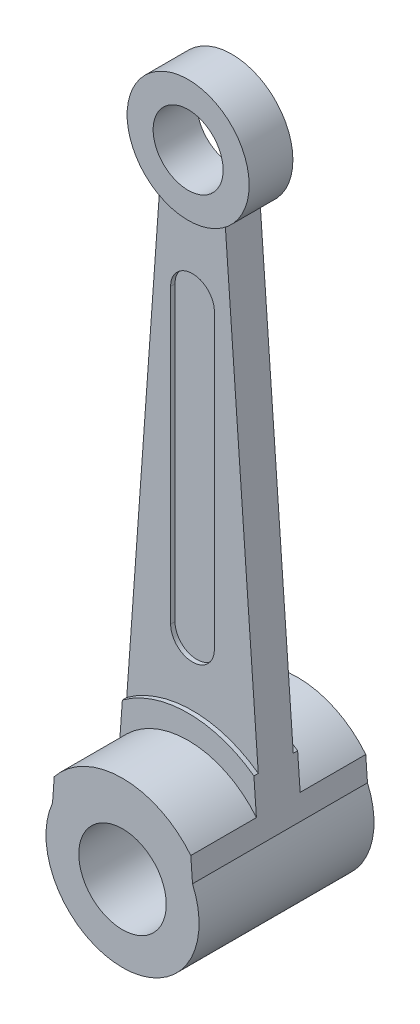
ISO-10303-21;
HEADER;
FILE_DESCRIPTION(('STEP AP214'),'2;1');
FILE_NAME('part.step','',(''),(''),'','','');
FILE_SCHEMA(('AUTOMOTIVE_DESIGN { 1 0 10303 214 1 1 1 1 }'));
ENDSEC;
DATA;
#1=APPLICATION_CONTEXT('core data for automotive mechanical design processes');
#2=APPLICATION_PROTOCOL_DEFINITION('international standard','automotive_design',2000,#1);
#3=PRODUCT_CONTEXT('',#1,'mechanical');
#4=PRODUCT('Part','Part','',(#3));
#5=PRODUCT_RELATED_PRODUCT_CATEGORY('part','',(#4));
#6=PRODUCT_DEFINITION_FORMATION('','',#4);
#7=PRODUCT_DEFINITION_CONTEXT('part definition',#1,'design');
#8=PRODUCT_DEFINITION('design','',#6,#7);
#9=PRODUCT_DEFINITION_SHAPE('','',#8);
#10=(LENGTH_UNIT() NAMED_UNIT(*) SI_UNIT(.MILLI.,.METRE.));
#11=(NAMED_UNIT(*) PLANE_ANGLE_UNIT() SI_UNIT($,.RADIAN.));
#12=(NAMED_UNIT(*) SI_UNIT($,.STERADIAN.) SOLID_ANGLE_UNIT());
#13=UNCERTAINTY_MEASURE_WITH_UNIT(LENGTH_MEASURE(1.E-05),#10,'distance_accuracy_value','');
#14=(GEOMETRIC_REPRESENTATION_CONTEXT(3) GLOBAL_UNCERTAINTY_ASSIGNED_CONTEXT((#13)) GLOBAL_UNIT_ASSIGNED_CONTEXT((#10,
#11,#12)) REPRESENTATION_CONTEXT('',''));
#15=CARTESIAN_POINT('',(0.,0.,0.));
#16=DIRECTION('',(0.,0.,1.));
#17=DIRECTION('',(1.,0.,0.));
#18=AXIS2_PLACEMENT_3D('',#15,#16,#17);
#19=CARTESIAN_POINT('',(1.86324788101989,-1.90582535700159,-0.499999999999999));
#20=DIRECTION('',(0.,0.,1.));
#21=DIRECTION('',(1.,0.,0.));
#22=AXIS2_PLACEMENT_3D('',#19,#20,#21);
#23=CYLINDRICAL_SURFACE('',#22,2.54);
#24=DIRECTION('',(0.,0.,1.));
#25=VECTOR('',#24,1.);
#26=CARTESIAN_POINT('',(3.36688931810119,0.141285394445941,-0.499999999999999));
#27=LINE('',#26,#25);
#28=CARTESIAN_POINT('',(3.36688931810119,0.141285394445941,-0.499999999999999));
#29=VERTEX_POINT('',#28);
#30=CARTESIAN_POINT('',(3.36688931810119,0.141285394445941,-0.399999999999999));
#31=VERTEX_POINT('',#30);
#32=EDGE_CURVE('E319',#29,#31,#27,.T.);
#33=ORIENTED_EDGE('',*,*,#32,.F.);
#34=CARTESIAN_POINT('',(1.86324788101989,-1.90582535700159,-0.499999999999999));
#35=DIRECTION('',(0.,0.,1.));
#36=DIRECTION('',(1.,0.,0.));
#37=AXIS2_PLACEMENT_3D('',#34,#35,#36);
#38=CIRCLE('',#37,2.54);
#39=CARTESIAN_POINT('',(0.359606443938589,0.141285394445941,-0.499999999999999));
#40=VERTEX_POINT('',#39);
#41=EDGE_CURVE('E200',#29,#40,#38,.T.);
#42=ORIENTED_EDGE('',*,*,#41,.T.);
#43=DIRECTION('',(0.,0.,1.));
#44=VECTOR('',#43,1.);
#45=CARTESIAN_POINT('',(0.359606443938589,0.141285394445941,-0.499999999999999));
#46=LINE('',#45,#44);
#47=CARTESIAN_POINT('',(0.359606443938589,0.141285394445941,-0.399999999999999));
#48=VERTEX_POINT('',#47);
#49=EDGE_CURVE('E338',#48,#40,#46,.F.);
#50=ORIENTED_EDGE('',*,*,#49,.F.);
#51=CARTESIAN_POINT('',(1.86324788101989,-1.90582535700159,-0.399999999999999));
#52=DIRECTION('',(0.,0.,1.));
#53=DIRECTION('',(1.,0.,0.));
#54=AXIS2_PLACEMENT_3D('',#51,#52,#53);
#55=CIRCLE('',#54,2.54);
#56=EDGE_CURVE('E227',#31,#48,#55,.T.);
#57=ORIENTED_EDGE('',*,*,#56,.F.);
#58=EDGE_LOOP('',(#33,#42,#50,#57));
#59=FACE_BOUND('',#58,.T.);
#60=ADVANCED_FACE('F41',(#59),#23,.T.);
#61=CARTESIAN_POINT('',(1.86324788101989,2.09417464299841,0.400000000000001));
#62=DIRECTION('',(0.,0.,-1.));
#63=DIRECTION('',(-1.,0.,0.));
#64=AXIS2_PLACEMENT_3D('',#61,#62,#63);
#65=CYLINDRICAL_SURFACE('',#64,0.5);
#66=DIRECTION('',(0.,0.,-1.));
#67=VECTOR('',#66,1.);
#68=CARTESIAN_POINT('',(1.36324788101989,2.09417464299841,0.400000000000001));
#69=LINE('',#68,#67);
#70=CARTESIAN_POINT('',(1.36324788101989,2.09417464299841,-0.299999999999999));
#71=VERTEX_POINT('',#70);
#72=CARTESIAN_POINT('',(1.36324788101989,2.09417464299841,-0.399999999999999));
#73=VERTEX_POINT('',#72);
#74=EDGE_CURVE('E211',#71,#73,#69,.T.);
#75=ORIENTED_EDGE('',*,*,#74,.F.);
#76=CARTESIAN_POINT('',(1.86324788101989,2.09417464299841,-0.299999999999999));
#77=DIRECTION('',(0.,0.,1.));
#78=DIRECTION('',(1.,0.,0.));
#79=AXIS2_PLACEMENT_3D('',#76,#77,#78);
#80=CIRCLE('',#79,0.5);
#81=CARTESIAN_POINT('',(2.36324788101989,2.09417464299841,-0.299999999999999));
#82=VERTEX_POINT('',#81);
#83=EDGE_CURVE('E281',#71,#82,#80,.T.);
#84=ORIENTED_EDGE('',*,*,#83,.T.);
#85=DIRECTION('',(0.,0.,-1.));
#86=VECTOR('',#85,1.);
#87=CARTESIAN_POINT('',(2.36324788101989,2.09417464299841,0.400000000000001));
#88=LINE('',#87,#86);
#89=CARTESIAN_POINT('',(2.36324788101989,2.09417464299841,-0.399999999999999));
#90=VERTEX_POINT('',#89);
#91=EDGE_CURVE('E223',#82,#90,#88,.T.);
#92=ORIENTED_EDGE('',*,*,#91,.T.);
#93=CARTESIAN_POINT('',(1.86324788101989,2.09417464299841,-0.399999999999999));
#94=DIRECTION('',(0.,0.,1.));
#95=DIRECTION('',(1.,0.,0.));
#96=AXIS2_PLACEMENT_3D('',#93,#94,#95);
#97=CIRCLE('',#96,0.5);
#98=EDGE_CURVE('E243',#73,#90,#97,.T.);
#99=ORIENTED_EDGE('',*,*,#98,.F.);
#100=EDGE_LOOP('',(#75,#84,#92,#99));
#101=FACE_BOUND('',#100,.T.);
#102=ADVANCED_FACE('F399',(#101),#65,.F.);
#103=CARTESIAN_POINT('',(1.36324788101989,1.35174813270071,0.400000000000001));
#104=DIRECTION('',(1.,0.,0.));
#105=DIRECTION('',(0.,1.,0.));
#106=AXIS2_PLACEMENT_3D('',#103,#104,#105);
#107=PLANE('',#106);
#108=DIRECTION('',(0.,0.,-1.));
#109=VECTOR('',#108,1.);
#110=CARTESIAN_POINT('',(1.36324788101989,8.78417464299841,0.400000000000001));
#111=LINE('',#110,#109);
#112=CARTESIAN_POINT('',(1.36324788101989,8.78417464299841,-0.299999999999999));
#113=VERTEX_POINT('',#112);
#114=CARTESIAN_POINT('',(1.36324788101989,8.78417464299841,-0.399999999999999));
#115=VERTEX_POINT('',#114);
#116=EDGE_CURVE('E215',#113,#115,#111,.T.);
#117=ORIENTED_EDGE('',*,*,#116,.F.);
#118=DIRECTION('',(0.,-1.,0.));
#119=VECTOR('',#118,1.);
#120=CARTESIAN_POINT('',(1.36324788101989,1.35174813270071,-0.299999999999999));
#121=LINE('',#120,#119);
#122=EDGE_CURVE('E64',#113,#71,#121,.T.);
#123=ORIENTED_EDGE('',*,*,#122,.T.);
#124=ORIENTED_EDGE('',*,*,#74,.T.);
#125=DIRECTION('',(0.,-1.,0.));
#126=VECTOR('',#125,1.);
#127=CARTESIAN_POINT('',(1.36324788101989,1.35174813270071,-0.399999999999999));
#128=LINE('',#127,#126);
#129=EDGE_CURVE('E240',#115,#73,#128,.T.);
#130=ORIENTED_EDGE('',*,*,#129,.F.);
#131=EDGE_LOOP('',(#117,#123,#124,#130));
#132=FACE_BOUND('',#131,.T.);
#133=ADVANCED_FACE('F403',(#132),#107,.T.);
#134=CARTESIAN_POINT('',(1.86324788101989,8.78417464299841,0.400000000000001));
#135=DIRECTION('',(0.,0.,-1.));
#136=DIRECTION('',(-1.,0.,0.));
#137=AXIS2_PLACEMENT_3D('',#134,#135,#136);
#138=CYLINDRICAL_SURFACE('',#137,0.5);
#139=DIRECTION('',(0.,0.,-1.));
#140=VECTOR('',#139,1.);
#141=CARTESIAN_POINT('',(2.36324788101989,8.78417464299841,0.400000000000001));
#142=LINE('',#141,#140);
#143=CARTESIAN_POINT('',(2.36324788101989,8.78417464299841,-0.299999999999999));
#144=VERTEX_POINT('',#143);
#145=CARTESIAN_POINT('',(2.36324788101989,8.78417464299841,-0.399999999999999));
#146=VERTEX_POINT('',#145);
#147=EDGE_CURVE('E219',#144,#146,#142,.T.);
#148=ORIENTED_EDGE('',*,*,#147,.F.);
#149=CARTESIAN_POINT('',(1.86324788101989,8.78417464299841,-0.299999999999999));
#150=DIRECTION('',(0.,0.,1.));
#151=DIRECTION('',(1.,0.,0.));
#152=AXIS2_PLACEMENT_3D('',#149,#150,#151);
#153=CIRCLE('',#152,0.5);
#154=EDGE_CURVE('E275',#144,#113,#153,.T.);
#155=ORIENTED_EDGE('',*,*,#154,.T.);
#156=ORIENTED_EDGE('',*,*,#116,.T.);
#157=CARTESIAN_POINT('',(1.86324788101989,8.78417464299841,-0.399999999999999));
#158=DIRECTION('',(0.,0.,1.));
#159=DIRECTION('',(1.,0.,0.));
#160=AXIS2_PLACEMENT_3D('',#157,#158,#159);
#161=CIRCLE('',#160,0.5);
#162=EDGE_CURVE('E237',#146,#115,#161,.T.);
#163=ORIENTED_EDGE('',*,*,#162,.F.);
#164=EDGE_LOOP('',(#148,#155,#156,#163));
#165=FACE_BOUND('',#164,.T.);
#166=ADVANCED_FACE('F415',(#165),#138,.F.);
#167=CARTESIAN_POINT('',(2.36324788101989,1.35174813270071,0.400000000000001));
#168=DIRECTION('',(1.,0.,0.));
#169=DIRECTION('',(0.,1.,0.));
#170=AXIS2_PLACEMENT_3D('',#167,#168,#169);
#171=PLANE('',#170);
#172=DIRECTION('',(0.,-1.,0.));
#173=VECTOR('',#172,1.);
#174=CARTESIAN_POINT('',(2.36324788101989,1.35174813270071,-0.299999999999999));
#175=LINE('',#174,#173);
#176=EDGE_CURVE('E278',#144,#82,#175,.T.);
#177=ORIENTED_EDGE('',*,*,#176,.F.);
#178=ORIENTED_EDGE('',*,*,#147,.T.);
#179=DIRECTION('',(0.,-1.,0.));
#180=VECTOR('',#179,1.);
#181=CARTESIAN_POINT('',(2.36324788101989,1.35174813270071,-0.399999999999999));
#182=LINE('',#181,#180);
#183=EDGE_CURVE('E234',#146,#90,#182,.T.);
#184=ORIENTED_EDGE('',*,*,#183,.T.);
#185=ORIENTED_EDGE('',*,*,#91,.F.);
#186=EDGE_LOOP('',(#177,#178,#184,#185));
#187=FACE_BOUND('',#186,.T.);
#188=ADVANCED_FACE('F409',(#187),#171,.F.);
#189=CARTESIAN_POINT('',(3.36688931810119,0.141285394445941,0.400000000000001));
#190=VERTEX_POINT('',#189);
#191=CARTESIAN_POINT('',(3.36688931810119,0.141285394445941,0.500000000000001));
#192=VERTEX_POINT('',#191);
#193=EDGE_CURVE('E309',#190,#192,#27,.T.);
#194=ORIENTED_EDGE('',*,*,#193,.F.);
#195=CARTESIAN_POINT('',(1.86324788101989,-1.90582535700159,0.400000000000001));
#196=DIRECTION('',(0.,0.,1.));
#197=DIRECTION('',(1.,0.,0.));
#198=AXIS2_PLACEMENT_3D('',#195,#196,#197);
#199=CIRCLE('',#198,2.54);
#200=CARTESIAN_POINT('',(0.359606443938589,0.141285394445941,0.400000000000001));
#201=VERTEX_POINT('',#200);
#202=EDGE_CURVE('E247',#190,#201,#199,.T.);
#203=ORIENTED_EDGE('',*,*,#202,.T.);
#204=CARTESIAN_POINT('',(0.359606443938589,0.141285394445941,0.500000000000001));
#205=VERTEX_POINT('',#204);
#206=EDGE_CURVE('E328',#205,#201,#46,.F.);
#207=ORIENTED_EDGE('',*,*,#206,.F.);
#208=CARTESIAN_POINT('',(1.86324788101989,-1.90582535700159,0.500000000000001));
#209=DIRECTION('',(0.,0.,1.));
#210=DIRECTION('',(1.,0.,0.));
#211=AXIS2_PLACEMENT_3D('',#208,#209,#210);
#212=CIRCLE('',#211,2.54);
#213=EDGE_CURVE('E201',#192,#205,#212,.T.);
#214=ORIENTED_EDGE('',*,*,#213,.F.);
#215=EDGE_LOOP('',(#194,#203,#207,#214));
#216=FACE_BOUND('',#215,.T.);
#217=ADVANCED_FACE('F364',(#216),#23,.T.);
#218=CARTESIAN_POINT('',(1.6769230929179,1.35174813270071,-0.499999999999999));
#219=DIRECTION('',(0.,0.,1.));
#220=DIRECTION('',(1.,0.,0.));
#221=AXIS2_PLACEMENT_3D('',#218,#219,#220);
#222=PLANE('',#221);
#223=ORIENTED_EDGE('',*,*,#41,.F.);
#224=DIRECTION('',(0.0718181006562888,-0.997417746191696,0.));
#225=VECTOR('',#224,1.);
#226=CARTESIAN_POINT('',(3.27146409205458,1.46656151597349,-0.499999999999999));
#227=LINE('',#226,#225);
#228=CARTESIAN_POINT('',(3.42426347546753,-0.655533265572038,-0.499999999999999));
#229=VERTEX_POINT('',#228);
#230=EDGE_CURVE('E321',#29,#229,#227,.T.);
#231=ORIENTED_EDGE('',*,*,#230,.T.);
#232=CARTESIAN_POINT('',(1.86324788101989,-1.90582535700159,-0.499999999999999));
#233=DIRECTION('',(0.,0.,1.));
#234=DIRECTION('',(1.,0.,0.));
#235=AXIS2_PLACEMENT_3D('',#232,#233,#234);
#236=CIRCLE('',#235,2.);
#237=CARTESIAN_POINT('',(0.302232286572251,-0.655533265572039,-0.499999999999999));
#238=VERTEX_POINT('',#237);
#239=EDGE_CURVE('E285',#229,#238,#236,.T.);
#240=ORIENTED_EDGE('',*,*,#239,.T.);
#241=DIRECTION('',(0.0718181006562885,0.997417746191696,0.));
#242=VECTOR('',#241,1.);
#243=CARTESIAN_POINT('',(0.453109603250883,1.4398676400195,-0.499999999999999));
#244=LINE('',#243,#242);
#245=EDGE_CURVE('E340',#238,#40,#244,.T.);
#246=ORIENTED_EDGE('',*,*,#245,.T.);
#247=EDGE_LOOP('',(#223,#231,#240,#246));
#248=FACE_BOUND('',#247,.T.);
#249=ADVANCED_FACE('F384',(#248),#222,.F.);
#250=CARTESIAN_POINT('',(1.6769230929179,1.35174813270071,0.500000000000001));
#251=DIRECTION('',(0.,0.,1.));
#252=DIRECTION('',(1.,0.,0.));
#253=AXIS2_PLACEMENT_3D('',#250,#251,#252);
#254=PLANE('',#253);
#255=DIRECTION('',(0.0718181006562888,-0.997417746191696,0.));
#256=VECTOR('',#255,1.);
#257=CARTESIAN_POINT('',(3.27146409205458,1.46656151597349,0.500000000000001));
#258=LINE('',#257,#256);
#259=CARTESIAN_POINT('',(3.42426347546753,-0.655533265572038,0.500000000000001));
#260=VERTEX_POINT('',#259);
#261=EDGE_CURVE('E310',#192,#260,#258,.T.);
#262=ORIENTED_EDGE('',*,*,#261,.F.);
#263=ORIENTED_EDGE('',*,*,#213,.T.);
#264=DIRECTION('',(0.0718181006562885,0.997417746191696,0.));
#265=VECTOR('',#264,1.);
#266=CARTESIAN_POINT('',(0.453109603250883,1.4398676400195,0.500000000000001));
#267=LINE('',#266,#265);
#268=CARTESIAN_POINT('',(0.302232286572251,-0.655533265572039,0.500000000000001));
#269=VERTEX_POINT('',#268);
#270=EDGE_CURVE('E329',#269,#205,#267,.T.);
#271=ORIENTED_EDGE('',*,*,#270,.F.);
#272=CARTESIAN_POINT('',(1.86324788101989,-1.90582535700159,0.500000000000001));
#273=DIRECTION('',(0.,0.,1.));
#274=DIRECTION('',(1.,0.,0.));
#275=AXIS2_PLACEMENT_3D('',#272,#273,#274);
#276=CIRCLE('',#275,2.);
#277=EDGE_CURVE('E186',#260,#269,#276,.T.);
#278=ORIENTED_EDGE('',*,*,#277,.F.);
#279=EDGE_LOOP('',(#262,#263,#271,#278));
#280=FACE_BOUND('',#279,.T.);
#281=ADVANCED_FACE('F358',(#280),#254,.T.);
#282=CARTESIAN_POINT('',(1.86324788101989,2.09417464299841,0.300000000000001));
#283=DIRECTION('',(0.,0.,1.));
#284=DIRECTION('',(1.,0.,0.));
#285=AXIS2_PLACEMENT_3D('',#282,#283,#284);
#286=CIRCLE('',#285,0.5);
#287=CARTESIAN_POINT('',(1.36324788101989,2.09417464299841,0.300000000000001));
#288=VERTEX_POINT('',#287);
#289=CARTESIAN_POINT('',(2.36324788101989,2.09417464299841,0.300000000000001));
#290=VERTEX_POINT('',#289);
#291=EDGE_CURVE('E290',#288,#290,#286,.T.);
#292=ORIENTED_EDGE('',*,*,#291,.F.);
#293=CARTESIAN_POINT('',(1.36324788101989,2.09417464299841,0.400000000000001));
#294=VERTEX_POINT('',#293);
#295=EDGE_CURVE('E207',#294,#288,#69,.T.);
#296=ORIENTED_EDGE('',*,*,#295,.F.);
#297=CARTESIAN_POINT('',(1.86324788101989,2.09417464299841,0.400000000000001));
#298=DIRECTION('',(0.,0.,1.));
#299=DIRECTION('',(1.,0.,0.));
#300=AXIS2_PLACEMENT_3D('',#297,#298,#299);
#301=CIRCLE('',#300,0.5);
#302=CARTESIAN_POINT('',(2.36324788101989,2.09417464299841,0.400000000000001));
#303=VERTEX_POINT('',#302);
#304=EDGE_CURVE('E230',#294,#303,#301,.T.);
#305=ORIENTED_EDGE('',*,*,#304,.T.);
#306=EDGE_CURVE('E220',#303,#290,#88,.T.);
#307=ORIENTED_EDGE('',*,*,#306,.T.);
#308=EDGE_LOOP('',(#292,#296,#305,#307));
#309=FACE_BOUND('',#308,.T.);
#310=ADVANCED_FACE('F406',(#309),#65,.F.);
#311=DIRECTION('',(0.,-1.,0.));
#312=VECTOR('',#311,1.);
#313=CARTESIAN_POINT('',(1.36324788101989,1.35174813270071,0.300000000000001));
#314=LINE('',#313,#312);
#315=CARTESIAN_POINT('',(1.36324788101989,8.78417464299841,0.300000000000001));
#316=VERTEX_POINT('',#315);
#317=EDGE_CURVE('E277',#316,#288,#314,.T.);
#318=ORIENTED_EDGE('',*,*,#317,.F.);
#319=CARTESIAN_POINT('',(1.36324788101989,8.78417464299841,0.400000000000001));
#320=VERTEX_POINT('',#319);
#321=EDGE_CURVE('E212',#320,#316,#111,.T.);
#322=ORIENTED_EDGE('',*,*,#321,.F.);
#323=DIRECTION('',(0.,-1.,0.));
#324=VECTOR('',#323,1.);
#325=CARTESIAN_POINT('',(1.36324788101989,1.35174813270071,0.400000000000001));
#326=LINE('',#325,#324);
#327=EDGE_CURVE('E258',#320,#294,#326,.T.);
#328=ORIENTED_EDGE('',*,*,#327,.T.);
#329=ORIENTED_EDGE('',*,*,#295,.T.);
#330=EDGE_LOOP('',(#318,#322,#328,#329));
#331=FACE_BOUND('',#330,.T.);
#332=ADVANCED_FACE('F433',(#331),#107,.T.);
#333=CARTESIAN_POINT('',(1.86324788101989,8.78417464299841,0.300000000000001));
#334=DIRECTION('',(0.,0.,1.));
#335=DIRECTION('',(1.,0.,0.));
#336=AXIS2_PLACEMENT_3D('',#333,#334,#335);
#337=CIRCLE('',#336,0.5);
#338=CARTESIAN_POINT('',(2.36324788101989,8.78417464299841,0.300000000000001));
#339=VERTEX_POINT('',#338);
#340=EDGE_CURVE('E270',#339,#316,#337,.T.);
#341=ORIENTED_EDGE('',*,*,#340,.F.);
#342=CARTESIAN_POINT('',(2.36324788101989,8.78417464299841,0.400000000000001));
#343=VERTEX_POINT('',#342);
#344=EDGE_CURVE('E216',#343,#339,#142,.T.);
#345=ORIENTED_EDGE('',*,*,#344,.F.);
#346=CARTESIAN_POINT('',(1.86324788101989,8.78417464299841,0.400000000000001));
#347=DIRECTION('',(0.,0.,1.));
#348=DIRECTION('',(1.,0.,0.));
#349=AXIS2_PLACEMENT_3D('',#346,#347,#348);
#350=CIRCLE('',#349,0.5);
#351=EDGE_CURVE('E255',#343,#320,#350,.T.);
#352=ORIENTED_EDGE('',*,*,#351,.T.);
#353=ORIENTED_EDGE('',*,*,#321,.T.);
#354=EDGE_LOOP('',(#341,#345,#352,#353));
#355=FACE_BOUND('',#354,.T.);
#356=ADVANCED_FACE('F424',(#355),#138,.F.);
#357=ORIENTED_EDGE('',*,*,#344,.T.);
#358=DIRECTION('',(0.,-1.,0.));
#359=VECTOR('',#358,1.);
#360=CARTESIAN_POINT('',(2.36324788101989,1.35174813270071,0.300000000000001));
#361=LINE('',#360,#359);
#362=EDGE_CURVE('E287',#339,#290,#361,.T.);
#363=ORIENTED_EDGE('',*,*,#362,.T.);
#364=ORIENTED_EDGE('',*,*,#306,.F.);
#365=DIRECTION('',(0.,-1.,0.));
#366=VECTOR('',#365,1.);
#367=CARTESIAN_POINT('',(2.36324788101989,1.35174813270071,0.400000000000001));
#368=LINE('',#367,#366);
#369=EDGE_CURVE('E253',#343,#303,#368,.T.);
#370=ORIENTED_EDGE('',*,*,#369,.F.);
#371=EDGE_LOOP('',(#357,#363,#364,#370));
#372=FACE_BOUND('',#371,.T.);
#373=ADVANCED_FACE('F418',(#372),#171,.F.);
#374=CARTESIAN_POINT('',(1.6769230929179,1.35174813270071,0.400000000000001));
#375=DIRECTION('',(0.,0.,1.));
#376=DIRECTION('',(1.,0.,0.));
#377=AXIS2_PLACEMENT_3D('',#374,#375,#376);
#378=PLANE('',#377);
#379=DIRECTION('',(0.0718181006562888,-0.997417746191696,0.));
#380=VECTOR('',#379,1.);
#381=CARTESIAN_POINT('',(3.27146409205458,1.46656151597349,0.400000000000001));
#382=LINE('',#381,#380);
#383=CARTESIAN_POINT('',(2.61324788101989,10.6079412477915,0.400000000000001));
#384=VERTEX_POINT('',#383);
#385=EDGE_CURVE('E307',#384,#190,#382,.T.);
#386=ORIENTED_EDGE('',*,*,#385,.F.);
#387=CARTESIAN_POINT('',(1.86324788101989,11.7841746429984,0.400000000000001));
#388=DIRECTION('',(0.,0.,1.));
#389=DIRECTION('',(1.,0.,0.));
#390=AXIS2_PLACEMENT_3D('',#387,#388,#389);
#391=CIRCLE('',#390,1.395);
#392=CARTESIAN_POINT('',(1.11324788101989,10.6079412477915,0.400000000000001));
#393=VERTEX_POINT('',#392);
#394=EDGE_CURVE('E250',#393,#384,#391,.T.);
#395=ORIENTED_EDGE('',*,*,#394,.F.);
#396=DIRECTION('',(0.0718181006562885,0.997417746191696,0.));
#397=VECTOR('',#396,1.);
#398=CARTESIAN_POINT('',(0.453109603250883,1.4398676400195,0.400000000000001));
#399=LINE('',#398,#397);
#400=EDGE_CURVE('E326',#201,#393,#399,.T.);
#401=ORIENTED_EDGE('',*,*,#400,.F.);
#402=ORIENTED_EDGE('',*,*,#202,.F.);
#403=EDGE_LOOP('',(#386,#395,#401,#402));
#404=FACE_BOUND('',#403,.T.);
#405=ORIENTED_EDGE('',*,*,#304,.F.);
#406=ORIENTED_EDGE('',*,*,#327,.F.);
#407=ORIENTED_EDGE('',*,*,#351,.F.);
#408=ORIENTED_EDGE('',*,*,#369,.T.);
#409=EDGE_LOOP('',(#405,#406,#407,#408));
#410=FACE_BOUND('',#409,.T.);
#411=ADVANCED_FACE('F368',(#404,#410),#378,.T.);
#412=CARTESIAN_POINT('',(1.6769230929179,1.35174813270071,-0.399999999999999));
#413=DIRECTION('',(0.,0.,1.));
#414=DIRECTION('',(1.,0.,0.));
#415=AXIS2_PLACEMENT_3D('',#412,#413,#414);
#416=PLANE('',#415);
#417=ORIENTED_EDGE('',*,*,#98,.T.);
#418=ORIENTED_EDGE('',*,*,#183,.F.);
#419=ORIENTED_EDGE('',*,*,#162,.T.);
#420=ORIENTED_EDGE('',*,*,#129,.T.);
#421=EDGE_LOOP('',(#417,#418,#419,#420));
#422=FACE_BOUND('',#421,.T.);
#423=CARTESIAN_POINT('',(1.86324788101989,11.7841746429984,-0.399999999999999));
#424=DIRECTION('',(0.,0.,1.));
#425=DIRECTION('',(1.,0.,0.));
#426=AXIS2_PLACEMENT_3D('',#423,#424,#425);
#427=CIRCLE('',#426,1.395);
#428=CARTESIAN_POINT('',(1.11324788101989,10.6079412477915,-0.399999999999999));
#429=VERTEX_POINT('',#428);
#430=CARTESIAN_POINT('',(2.61324788101989,10.6079412477915,-0.399999999999999));
#431=VERTEX_POINT('',#430);
#432=EDGE_CURVE('E231',#429,#431,#427,.T.);
#433=ORIENTED_EDGE('',*,*,#432,.T.);
#434=DIRECTION('',(0.0718181006562888,-0.997417746191696,0.));
#435=VECTOR('',#434,1.);
#436=CARTESIAN_POINT('',(3.27146409205458,1.46656151597349,-0.399999999999999));
#437=LINE('',#436,#435);
#438=EDGE_CURVE('E316',#431,#31,#437,.T.);
#439=ORIENTED_EDGE('',*,*,#438,.T.);
#440=ORIENTED_EDGE('',*,*,#56,.T.);
#441=DIRECTION('',(0.0718181006562885,0.997417746191696,0.));
#442=VECTOR('',#441,1.);
#443=CARTESIAN_POINT('',(0.453109603250883,1.4398676400195,-0.399999999999999));
#444=LINE('',#443,#442);
#445=EDGE_CURVE('E335',#48,#429,#444,.T.);
#446=ORIENTED_EDGE('',*,*,#445,.T.);
#447=EDGE_LOOP('',(#433,#439,#440,#446));
#448=FACE_BOUND('',#447,.T.);
#449=ADVANCED_FACE('F377',(#422,#448),#416,.F.);
#450=CARTESIAN_POINT('',(1.86324788101989,11.7841746429984,-0.499999999999999));
#451=DIRECTION('',(0.,0.,1.));
#452=DIRECTION('',(1.,0.,0.));
#453=AXIS2_PLACEMENT_3D('',#450,#451,#452);
#454=CYLINDRICAL_SURFACE('',#453,0.800000000000001);
#455=CARTESIAN_POINT('',(1.86324788101989,11.7841746429984,-0.499999999999999));
#456=DIRECTION('',(0.,0.,1.));
#457=DIRECTION('',(1.,0.,0.));
#458=AXIS2_PLACEMENT_3D('',#455,#456,#457);
#459=CIRCLE('',#458,0.800000000000001);
#460=CARTESIAN_POINT('',(2.66324788101989,11.7841746429984,-0.499999999999999));
#461=VERTEX_POINT('',#460);
#462=EDGE_CURVE('E266',#461,#461,#459,.T.);
#463=ORIENTED_EDGE('',*,*,#462,.F.);
#464=EDGE_LOOP('',(#463));
#465=FACE_BOUND('',#464,.T.);
#466=CARTESIAN_POINT('',(1.86324788101989,11.7841746429984,0.500000000000001));
#467=DIRECTION('',(0.,0.,1.));
#468=DIRECTION('',(1.,0.,0.));
#469=AXIS2_PLACEMENT_3D('',#466,#467,#468);
#470=CIRCLE('',#469,0.800000000000001);
#471=CARTESIAN_POINT('',(2.66324788101989,11.7841746429984,0.500000000000001));
#472=VERTEX_POINT('',#471);
#473=EDGE_CURVE('E267',#472,#472,#470,.T.);
#474=ORIENTED_EDGE('',*,*,#473,.T.);
#475=EDGE_LOOP('',(#474));
#476=FACE_BOUND('',#475,.T.);
#477=ADVANCED_FACE('F609',(#465,#476),#454,.F.);
#478=CARTESIAN_POINT('',(1.86324788101989,11.7841746429984,-0.499999999999999));
#479=DIRECTION('',(0.,0.,1.));
#480=DIRECTION('',(1.,0.,0.));
#481=AXIS2_PLACEMENT_3D('',#478,#479,#480);
#482=CYLINDRICAL_SURFACE('',#481,1.395);
#483=DIRECTION('',(0.,0.,-1.));
#484=VECTOR('',#483,1.);
#485=CARTESIAN_POINT('',(2.61324788101989,10.6079412477915,0.400000000000001));
#486=LINE('',#485,#484);
#487=EDGE_CURVE('E210',#384,#431,#486,.T.);
#488=ORIENTED_EDGE('',*,*,#487,.T.);
#489=ORIENTED_EDGE('',*,*,#432,.F.);
#490=DIRECTION('',(0.,0.,-1.));
#491=VECTOR('',#490,1.);
#492=CARTESIAN_POINT('',(1.11324788101989,10.6079412477915,0.400000000000001));
#493=LINE('',#492,#491);
#494=EDGE_CURVE('E204',#393,#429,#493,.T.);
#495=ORIENTED_EDGE('',*,*,#494,.F.);
#496=ORIENTED_EDGE('',*,*,#394,.T.);
#497=EDGE_LOOP('',(#488,#489,#495,#496));
#498=FACE_BOUND('',#497,.T.);
#499=CARTESIAN_POINT('',(1.86324788101989,11.7841746429984,0.500000000000001));
#500=DIRECTION('',(0.,0.,1.));
#501=DIRECTION('',(1.,0.,0.));
#502=AXIS2_PLACEMENT_3D('',#499,#500,#501);
#503=CIRCLE('',#502,1.395);
#504=CARTESIAN_POINT('',(3.25824788101989,11.7841746429984,0.500000000000001));
#505=VERTEX_POINT('',#504);
#506=EDGE_CURVE('E263',#505,#505,#503,.T.);
#507=ORIENTED_EDGE('',*,*,#506,.F.);
#508=EDGE_LOOP('',(#507));
#509=FACE_BOUND('',#508,.T.);
#510=CARTESIAN_POINT('',(1.86324788101989,11.7841746429984,-0.499999999999999));
#511=DIRECTION('',(0.,0.,1.));
#512=DIRECTION('',(1.,0.,0.));
#513=AXIS2_PLACEMENT_3D('',#510,#511,#512);
#514=CIRCLE('',#513,1.395);
#515=CARTESIAN_POINT('',(3.25824788101989,11.7841746429984,-0.499999999999999));
#516=VERTEX_POINT('',#515);
#517=EDGE_CURVE('E246',#516,#516,#514,.T.);
#518=ORIENTED_EDGE('',*,*,#517,.T.);
#519=EDGE_LOOP('',(#518));
#520=FACE_BOUND('',#519,.T.);
#521=ADVANCED_FACE('F374',(#498,#509,#520),#482,.T.);
#522=CARTESIAN_POINT('',(1.6769230929179,1.35174813270071,-0.499999999999999));
#523=DIRECTION('',(0.,0.,1.));
#524=DIRECTION('',(1.,0.,0.));
#525=AXIS2_PLACEMENT_3D('',#522,#523,#524);
#526=PLANE('',#525);
#527=ORIENTED_EDGE('',*,*,#462,.T.);
#528=EDGE_LOOP('',(#527));
#529=FACE_BOUND('',#528,.T.);
#530=ORIENTED_EDGE('',*,*,#517,.F.);
#531=EDGE_LOOP('',(#530));
#532=FACE_BOUND('',#531,.T.);
#533=ADVANCED_FACE('F589',(#529,#532),#526,.F.);
#534=CARTESIAN_POINT('',(1.6769230929179,1.35174813270071,0.500000000000001));
#535=DIRECTION('',(0.,0.,1.));
#536=DIRECTION('',(1.,0.,0.));
#537=AXIS2_PLACEMENT_3D('',#534,#535,#536);
#538=PLANE('',#537);
#539=ORIENTED_EDGE('',*,*,#473,.F.);
#540=EDGE_LOOP('',(#539));
#541=FACE_BOUND('',#540,.T.);
#542=ORIENTED_EDGE('',*,*,#506,.T.);
#543=EDGE_LOOP('',(#542));
#544=FACE_BOUND('',#543,.T.);
#545=ADVANCED_FACE('F580',(#541,#544),#538,.T.);
#546=CARTESIAN_POINT('',(1.6769230929179,1.35174813270071,-0.299999999999999));
#547=DIRECTION('',(0.,0.,1.));
#548=DIRECTION('',(1.,0.,0.));
#549=AXIS2_PLACEMENT_3D('',#546,#547,#548);
#550=PLANE('',#549);
#551=ORIENTED_EDGE('',*,*,#122,.F.);
#552=ORIENTED_EDGE('',*,*,#154,.F.);
#553=ORIENTED_EDGE('',*,*,#176,.T.);
#554=ORIENTED_EDGE('',*,*,#83,.F.);
#555=EDGE_LOOP('',(#551,#552,#553,#554));
#556=FACE_BOUND('',#555,.T.);
#557=ADVANCED_FACE('F571',(#556),#550,.F.);
#558=CARTESIAN_POINT('',(1.6769230929179,1.35174813270071,0.300000000000001));
#559=DIRECTION('',(0.,0.,1.));
#560=DIRECTION('',(1.,0.,0.));
#561=AXIS2_PLACEMENT_3D('',#558,#559,#560);
#562=PLANE('',#561);
#563=ORIENTED_EDGE('',*,*,#317,.T.);
#564=ORIENTED_EDGE('',*,*,#291,.T.);
#565=ORIENTED_EDGE('',*,*,#362,.F.);
#566=ORIENTED_EDGE('',*,*,#340,.T.);
#567=EDGE_LOOP('',(#563,#564,#565,#566));
#568=FACE_BOUND('',#567,.T.);
#569=ADVANCED_FACE('F441',(#568),#562,.T.);
#570=CARTESIAN_POINT('',(1.86324788101989,-1.90582535700159,-2.));
#571=DIRECTION('',(0.,0.,1.));
#572=DIRECTION('',(1.,0.,0.));
#573=AXIS2_PLACEMENT_3D('',#570,#571,#572);
#574=CYLINDRICAL_SURFACE('',#573,2.);
#575=DIRECTION('',(0.,0.,1.));
#576=VECTOR('',#575,1.);
#577=CARTESIAN_POINT('',(3.42426347546753,-0.655533265572038,-2.));
#578=LINE('',#577,#576);
#579=CARTESIAN_POINT('',(3.42426347546753,-0.655533265572038,2.));
#580=VERTEX_POINT('',#579);
#581=EDGE_CURVE('E312',#260,#580,#578,.T.);
#582=ORIENTED_EDGE('',*,*,#581,.F.);
#583=ORIENTED_EDGE('',*,*,#277,.T.);
#584=DIRECTION('',(0.,0.,1.));
#585=VECTOR('',#584,1.);
#586=CARTESIAN_POINT('',(0.302232286572251,-0.655533265572039,-2.));
#587=LINE('',#586,#585);
#588=CARTESIAN_POINT('',(0.302232286572251,-0.655533265572039,2.));
#589=VERTEX_POINT('',#588);
#590=EDGE_CURVE('E331',#589,#269,#587,.F.);
#591=ORIENTED_EDGE('',*,*,#590,.F.);
#592=CARTESIAN_POINT('',(1.86324788101989,-1.90582535700159,2.));
#593=DIRECTION('',(0.,0.,1.));
#594=DIRECTION('',(1.,0.,0.));
#595=AXIS2_PLACEMENT_3D('',#592,#593,#594);
#596=CIRCLE('',#595,2.);
#597=EDGE_CURVE('E300',#580,#589,#596,.T.);
#598=ORIENTED_EDGE('',*,*,#597,.F.);
#599=EDGE_LOOP('',(#582,#583,#591,#598));
#600=FACE_BOUND('',#599,.T.);
#601=ADVANCED_FACE('F354',(#600),#574,.T.);
#602=CARTESIAN_POINT('',(1.86324788101989,-1.90582535700159,2.));
#603=DIRECTION('',(0.,0.,1.));
#604=DIRECTION('',(1.,0.,0.));
#605=AXIS2_PLACEMENT_3D('',#602,#603,#604);
#606=PLANE('',#605);
#607=DIRECTION('',(0.0718181006562888,-0.997417746191696,0.));
#608=VECTOR('',#607,1.);
#609=CARTESIAN_POINT('',(3.5057737408446,-1.78755687021975,2.));
#610=LINE('',#609,#608);
#611=CARTESIAN_POINT('',(3.46324788101989,-1.1969530130637,2.));
#612=VERTEX_POINT('',#611);
#613=EDGE_CURVE('E314',#580,#612,#610,.T.);
#614=ORIENTED_EDGE('',*,*,#613,.F.);
#615=ORIENTED_EDGE('',*,*,#597,.T.);
#616=DIRECTION('',(0.0718181006562885,0.997417746191696,0.));
#617=VECTOR('',#616,1.);
#618=CARTESIAN_POINT('',(0.220722021195182,-1.78755687021975,2.));
#619=LINE('',#618,#617);
#620=CARTESIAN_POINT('',(0.263247881019891,-1.1969530130637,2.));
#621=VERTEX_POINT('',#620);
#622=EDGE_CURVE('E333',#621,#589,#619,.T.);
#623=ORIENTED_EDGE('',*,*,#622,.F.);
#624=CARTESIAN_POINT('',(1.86324788101989,-1.90582535700159,2.));
#625=DIRECTION('',(0.,0.,1.));
#626=DIRECTION('',(1.,0.,0.));
#627=AXIS2_PLACEMENT_3D('',#624,#625,#626);
#628=CIRCLE('',#627,1.75);
#629=EDGE_CURVE('E193',#612,#621,#628,.F.);
#630=ORIENTED_EDGE('',*,*,#629,.F.);
#631=EDGE_LOOP('',(#614,#615,#623,#630));
#632=FACE_BOUND('',#631,.T.);
#633=CARTESIAN_POINT('',(1.86324788101989,-1.90582535700159,2.));
#634=DIRECTION('',(0.,0.,1.));
#635=DIRECTION('',(1.,0.,0.));
#636=AXIS2_PLACEMENT_3D('',#633,#634,#635);
#637=CIRCLE('',#636,1.);
#638=CARTESIAN_POINT('',(2.86324788101989,-1.90582535700159,2.));
#639=VERTEX_POINT('',#638);
#640=EDGE_CURVE('E303',#639,#639,#637,.T.);
#641=ORIENTED_EDGE('',*,*,#640,.F.);
#642=EDGE_LOOP('',(#641));
#643=FACE_BOUND('',#642,.T.);
#644=ADVANCED_FACE('F347',(#632,#643),#606,.T.);
#645=DIRECTION('',(0.,0.,1.));
#646=VECTOR('',#645,1.);
#647=CARTESIAN_POINT('',(3.42426347546753,-0.655533265572038,-2.));
#648=LINE('',#647,#646);
#649=CARTESIAN_POINT('',(3.42426347546753,-0.655533265572038,-2.));
#650=VERTEX_POINT('',#649);
#651=EDGE_CURVE('E324',#650,#229,#648,.T.);
#652=ORIENTED_EDGE('',*,*,#651,.F.);
#653=CARTESIAN_POINT('',(1.86324788101989,-1.90582535700159,-2.));
#654=DIRECTION('',(0.,0.,1.));
#655=DIRECTION('',(1.,0.,0.));
#656=AXIS2_PLACEMENT_3D('',#653,#654,#655);
#657=CIRCLE('',#656,2.);
#658=CARTESIAN_POINT('',(0.302232286572251,-0.655533265572039,-2.));
#659=VERTEX_POINT('',#658);
#660=EDGE_CURVE('E295',#650,#659,#657,.T.);
#661=ORIENTED_EDGE('',*,*,#660,.T.);
#662=DIRECTION('',(0.,0.,1.));
#663=VECTOR('',#662,1.);
#664=CARTESIAN_POINT('',(0.302232286572251,-0.655533265572039,-2.));
#665=LINE('',#664,#663);
#666=EDGE_CURVE('E56',#238,#659,#665,.F.);
#667=ORIENTED_EDGE('',*,*,#666,.F.);
#668=ORIENTED_EDGE('',*,*,#239,.F.);
#669=EDGE_LOOP('',(#652,#661,#667,#668));
#670=FACE_BOUND('',#669,.T.);
#671=ADVANCED_FACE('F388',(#670),#574,.T.);
#672=CARTESIAN_POINT('',(1.86324788101989,-1.90582535700159,-2.));
#673=DIRECTION('',(0.,0.,1.));
#674=DIRECTION('',(1.,0.,0.));
#675=AXIS2_PLACEMENT_3D('',#672,#673,#674);
#676=PLANE('',#675);
#677=CARTESIAN_POINT('',(1.86324788101989,-1.90582535700159,-2.));
#678=DIRECTION('',(0.,0.,1.));
#679=DIRECTION('',(1.,0.,0.));
#680=AXIS2_PLACEMENT_3D('',#677,#678,#679);
#681=CIRCLE('',#680,1.);
#682=CARTESIAN_POINT('',(2.86324788101989,-1.90582535700159,-2.));
#683=VERTEX_POINT('',#682);
#684=EDGE_CURVE('E297',#683,#683,#681,.T.);
#685=ORIENTED_EDGE('',*,*,#684,.T.);
#686=EDGE_LOOP('',(#685));
#687=FACE_BOUND('',#686,.T.);
#688=ORIENTED_EDGE('',*,*,#660,.F.);
#689=DIRECTION('',(0.0718181006562888,-0.997417746191696,0.));
#690=VECTOR('',#689,1.);
#691=CARTESIAN_POINT('',(3.5057737408446,-1.78755687021975,-2.));
#692=LINE('',#691,#690);
#693=CARTESIAN_POINT('',(3.46324788101989,-1.1969530130637,-2.));
#694=VERTEX_POINT('',#693);
#695=EDGE_CURVE('E11',#650,#694,#692,.T.);
#696=ORIENTED_EDGE('',*,*,#695,.T.);
#697=CARTESIAN_POINT('',(1.86324788101989,-1.90582535700159,-2.));
#698=DIRECTION('',(0.,0.,1.));
#699=DIRECTION('',(1.,0.,0.));
#700=AXIS2_PLACEMENT_3D('',#697,#698,#699);
#701=CIRCLE('',#700,1.75);
#702=CARTESIAN_POINT('',(0.263247881019891,-1.1969530130637,-2.));
#703=VERTEX_POINT('',#702);
#704=EDGE_CURVE('E49',#694,#703,#701,.F.);
#705=ORIENTED_EDGE('',*,*,#704,.T.);
#706=DIRECTION('',(0.0718181006562885,0.997417746191696,0.));
#707=VECTOR('',#706,1.);
#708=CARTESIAN_POINT('',(0.220722021195182,-1.78755687021975,-2.));
#709=LINE('',#708,#707);
#710=EDGE_CURVE('E177',#703,#659,#709,.T.);
#711=ORIENTED_EDGE('',*,*,#710,.T.);
#712=EDGE_LOOP('',(#688,#696,#705,#711));
#713=FACE_BOUND('',#712,.T.);
#714=ADVANCED_FACE('F196',(#687,#713),#676,.F.);
#715=CARTESIAN_POINT('',(1.86324788101989,-1.90582535700159,-0.499999999999999));
#716=DIRECTION('',(0.,0.,1.));
#717=DIRECTION('',(1.,0.,0.));
#718=AXIS2_PLACEMENT_3D('',#715,#716,#717);
#719=CYLINDRICAL_SURFACE('',#718,1.);
#720=ORIENTED_EDGE('',*,*,#640,.T.);
#721=EDGE_LOOP('',(#720));
#722=FACE_BOUND('',#721,.T.);
#723=ORIENTED_EDGE('',*,*,#684,.F.);
#724=EDGE_LOOP('',(#723));
#725=FACE_BOUND('',#724,.T.);
#726=ADVANCED_FACE('F43',(#722,#725),#719,.F.);
#727=CARTESIAN_POINT('',(1.86324788101989,-1.90582535700159,-2.75));
#728=DIRECTION('',(0.,0.,1.));
#729=DIRECTION('',(1.,0.,0.));
#730=AXIS2_PLACEMENT_3D('',#727,#728,#729);
#731=CYLINDRICAL_SURFACE('',#730,1.75);
#732=ORIENTED_EDGE('',*,*,#629,.T.);
#733=DIRECTION('',(0.,0.,1.));
#734=VECTOR('',#733,1.);
#735=CARTESIAN_POINT('',(0.263247881019891,-1.1969530130637,-2.75));
#736=LINE('',#735,#734);
#737=EDGE_CURVE('E180',#703,#621,#736,.T.);
#738=ORIENTED_EDGE('',*,*,#737,.F.);
#739=ORIENTED_EDGE('',*,*,#704,.F.);
#740=DIRECTION('',(0.,0.,1.));
#741=VECTOR('',#740,1.);
#742=CARTESIAN_POINT('',(3.46324788101989,-1.1969530130637,-2.75));
#743=LINE('',#742,#741);
#744=EDGE_CURVE('E194',#694,#612,#743,.T.);
#745=ORIENTED_EDGE('',*,*,#744,.T.);
#746=EDGE_LOOP('',(#732,#738,#739,#745));
#747=FACE_BOUND('',#746,.T.);
#748=ADVANCED_FACE('F189',(#747),#731,.T.);
#749=CARTESIAN_POINT('',(2.61324788101989,10.6079412477915,-2.75));
#750=DIRECTION('',(-0.997417746191696,-0.0718181006562888,0.));
#751=DIRECTION('',(0.0718181006562888,-0.997417746191696,0.));
#752=AXIS2_PLACEMENT_3D('',#749,#750,#751);
#753=PLANE('',#752);
#754=ORIENTED_EDGE('',*,*,#385,.T.);
#755=ORIENTED_EDGE('',*,*,#193,.T.);
#756=ORIENTED_EDGE('',*,*,#261,.T.);
#757=ORIENTED_EDGE('',*,*,#581,.T.);
#758=ORIENTED_EDGE('',*,*,#613,.T.);
#759=ORIENTED_EDGE('',*,*,#744,.F.);
#760=ORIENTED_EDGE('',*,*,#695,.F.);
#761=ORIENTED_EDGE('',*,*,#651,.T.);
#762=ORIENTED_EDGE('',*,*,#230,.F.);
#763=ORIENTED_EDGE('',*,*,#32,.T.);
#764=ORIENTED_EDGE('',*,*,#438,.F.);
#765=ORIENTED_EDGE('',*,*,#487,.F.);
#766=EDGE_LOOP('',(#754,#755,#756,#757,#758,#759,#760,#761,#762,#763,#764,#765));
#767=FACE_BOUND('',#766,.T.);
#768=ADVANCED_FACE('F389',(#767),#753,.F.);
#769=CARTESIAN_POINT('',(1.11324788101989,10.6079412477915,-2.75));
#770=DIRECTION('',(0.997417746191696,-0.0718181006562885,0.));
#771=DIRECTION('',(0.0718181006562885,0.997417746191696,0.));
#772=AXIS2_PLACEMENT_3D('',#769,#770,#771);
#773=PLANE('',#772);
#774=ORIENTED_EDGE('',*,*,#400,.T.);
#775=ORIENTED_EDGE('',*,*,#494,.T.);
#776=ORIENTED_EDGE('',*,*,#445,.F.);
#777=ORIENTED_EDGE('',*,*,#49,.T.);
#778=ORIENTED_EDGE('',*,*,#245,.F.);
#779=ORIENTED_EDGE('',*,*,#666,.T.);
#780=ORIENTED_EDGE('',*,*,#710,.F.);
#781=ORIENTED_EDGE('',*,*,#737,.T.);
#782=ORIENTED_EDGE('',*,*,#622,.T.);
#783=ORIENTED_EDGE('',*,*,#590,.T.);
#784=ORIENTED_EDGE('',*,*,#270,.T.);
#785=ORIENTED_EDGE('',*,*,#206,.T.);
#786=EDGE_LOOP('',(#774,#775,#776,#777,#778,#779,#780,#781,#782,#783,#784,#785));
#787=FACE_BOUND('',#786,.T.);
#788=ADVANCED_FACE('F179',(#787),#773,.F.);
#789=CLOSED_SHELL('',(#60,#102,#133,#166,#188,#217,#249,#281,#310,#332,#356,#373,#411,#449,#477,
#521,#533,#545,#557,#569,#601,#644,#671,#714,#726,#748,#768,#788));
#790=MANIFOLD_SOLID_BREP('B2',#789);
#791=ADVANCED_BREP_SHAPE_REPRESENTATION('',(#18,#790),#14);
#792=SHAPE_DEFINITION_REPRESENTATION(#9,#791);
ENDSEC;
END-ISO-10303-21;
